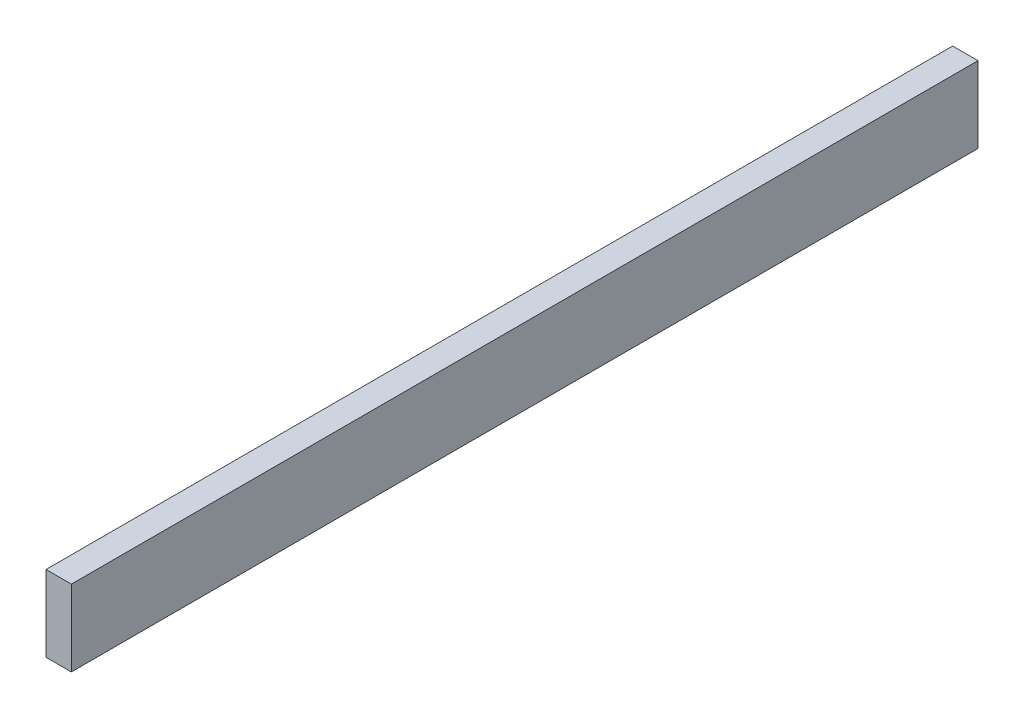
ISO-10303-21;
HEADER;
FILE_DESCRIPTION(('STEP AP214'),'2;1');
FILE_NAME('part.step','',(''),(''),'','','');
FILE_SCHEMA(('AUTOMOTIVE_DESIGN { 1 0 10303 214 1 1 1 1 }'));
ENDSEC;
DATA;
#1=APPLICATION_CONTEXT('core data for automotive mechanical design processes');
#2=APPLICATION_PROTOCOL_DEFINITION('international standard','automotive_design',2000,#1);
#3=PRODUCT_CONTEXT('',#1,'mechanical');
#4=PRODUCT('Part','Part','',(#3));
#5=PRODUCT_RELATED_PRODUCT_CATEGORY('part','',(#4));
#6=PRODUCT_DEFINITION_FORMATION('','',#4);
#7=PRODUCT_DEFINITION_CONTEXT('part definition',#1,'design');
#8=PRODUCT_DEFINITION('design','',#6,#7);
#9=PRODUCT_DEFINITION_SHAPE('','',#8);
#10=(LENGTH_UNIT() NAMED_UNIT(*) SI_UNIT(.MILLI.,.METRE.));
#11=(NAMED_UNIT(*) PLANE_ANGLE_UNIT() SI_UNIT($,.RADIAN.));
#12=(NAMED_UNIT(*) SI_UNIT($,.STERADIAN.) SOLID_ANGLE_UNIT());
#13=UNCERTAINTY_MEASURE_WITH_UNIT(LENGTH_MEASURE(1.E-05),#10,'distance_accuracy_value','');
#14=(GEOMETRIC_REPRESENTATION_CONTEXT(3) GLOBAL_UNCERTAINTY_ASSIGNED_CONTEXT((#13)) GLOBAL_UNIT_ASSIGNED_CONTEXT((#10,
#11,#12)) REPRESENTATION_CONTEXT('',''));
#15=CARTESIAN_POINT('',(0.,0.,0.));
#16=DIRECTION('',(0.,0.,1.));
#17=DIRECTION('',(1.,0.,0.));
#18=AXIS2_PLACEMENT_3D('',#15,#16,#17);
#19=CARTESIAN_POINT('',(-10.,60.,357.5));
#20=DIRECTION('',(0.,0.,-1.));
#21=DIRECTION('',(-1.,0.,0.));
#22=AXIS2_PLACEMENT_3D('',#19,#20,#21);
#23=PLANE('',#22);
#24=DIRECTION('',(1.,0.,0.));
#25=VECTOR('',#24,1.);
#26=CARTESIAN_POINT('',(-10.,0.,357.5));
#27=LINE('',#26,#25);
#28=CARTESIAN_POINT('',(-10.,0.,357.5));
#29=VERTEX_POINT('',#28);
#30=CARTESIAN_POINT('',(10.,0.,357.5));
#31=VERTEX_POINT('',#30);
#32=EDGE_CURVE('E98',#29,#31,#27,.T.);
#33=ORIENTED_EDGE('',*,*,#32,.T.);
#34=DIRECTION('',(0.,-1.,0.));
#35=VECTOR('',#34,1.);
#36=CARTESIAN_POINT('',(10.,60.,357.5));
#37=LINE('',#36,#35);
#38=CARTESIAN_POINT('',(10.,60.,357.5));
#39=VERTEX_POINT('',#38);
#40=EDGE_CURVE('E11',#39,#31,#37,.T.);
#41=ORIENTED_EDGE('',*,*,#40,.F.);
#42=DIRECTION('',(1.,0.,0.));
#43=VECTOR('',#42,1.);
#44=CARTESIAN_POINT('',(-10.,60.,357.5));
#45=LINE('',#44,#43);
#46=CARTESIAN_POINT('',(-10.,60.,357.5));
#47=VERTEX_POINT('',#46);
#48=EDGE_CURVE('E84',#47,#39,#45,.T.);
#49=ORIENTED_EDGE('',*,*,#48,.F.);
#50=DIRECTION('',(0.,-1.,0.));
#51=VECTOR('',#50,1.);
#52=CARTESIAN_POINT('',(-10.,60.,357.5));
#53=LINE('',#52,#51);
#54=EDGE_CURVE('E51',#47,#29,#53,.T.);
#55=ORIENTED_EDGE('',*,*,#54,.T.);
#56=EDGE_LOOP('',(#33,#41,#49,#55));
#57=FACE_BOUND('',#56,.T.);
#58=ADVANCED_FACE('F35',(#57),#23,.F.);
#59=CARTESIAN_POINT('',(10.,60.,357.5));
#60=DIRECTION('',(-1.,0.,0.));
#61=DIRECTION('',(0.,0.,1.));
#62=AXIS2_PLACEMENT_3D('',#59,#60,#61);
#63=PLANE('',#62);
#64=DIRECTION('',(0.,0.,-1.));
#65=VECTOR('',#64,1.);
#66=CARTESIAN_POINT('',(10.,0.,357.5));
#67=LINE('',#66,#65);
#68=CARTESIAN_POINT('',(10.,0.,-357.5));
#69=VERTEX_POINT('',#68);
#70=EDGE_CURVE('E89',#31,#69,#67,.T.);
#71=ORIENTED_EDGE('',*,*,#70,.T.);
#72=DIRECTION('',(0.,-1.,0.));
#73=VECTOR('',#72,1.);
#74=CARTESIAN_POINT('',(10.,60.,-357.5));
#75=LINE('',#74,#73);
#76=CARTESIAN_POINT('',(10.,60.,-357.5));
#77=VERTEX_POINT('',#76);
#78=EDGE_CURVE('E43',#77,#69,#75,.T.);
#79=ORIENTED_EDGE('',*,*,#78,.F.);
#80=DIRECTION('',(0.,0.,-1.));
#81=VECTOR('',#80,1.);
#82=CARTESIAN_POINT('',(10.,60.,357.5));
#83=LINE('',#82,#81);
#84=EDGE_CURVE('E76',#39,#77,#83,.T.);
#85=ORIENTED_EDGE('',*,*,#84,.F.);
#86=ORIENTED_EDGE('',*,*,#40,.T.);
#87=EDGE_LOOP('',(#71,#79,#85,#86));
#88=FACE_BOUND('',#87,.T.);
#89=ADVANCED_FACE('F88',(#88),#63,.F.);
#90=CARTESIAN_POINT('',(-10.,60.,-357.5));
#91=DIRECTION('',(0.,0.,-1.));
#92=DIRECTION('',(-1.,0.,0.));
#93=AXIS2_PLACEMENT_3D('',#90,#91,#92);
#94=PLANE('',#93);
#95=DIRECTION('',(1.,0.,0.));
#96=VECTOR('',#95,1.);
#97=CARTESIAN_POINT('',(-10.,0.,-357.5));
#98=LINE('',#97,#96);
#99=CARTESIAN_POINT('',(-10.,0.,-357.5));
#100=VERTEX_POINT('',#99);
#101=EDGE_CURVE('E101',#100,#69,#98,.T.);
#102=ORIENTED_EDGE('',*,*,#101,.F.);
#103=DIRECTION('',(0.,-1.,0.));
#104=VECTOR('',#103,1.);
#105=CARTESIAN_POINT('',(-10.,60.,-357.5));
#106=LINE('',#105,#104);
#107=CARTESIAN_POINT('',(-10.,60.,-357.5));
#108=VERTEX_POINT('',#107);
#109=EDGE_CURVE('E65',#108,#100,#106,.T.);
#110=ORIENTED_EDGE('',*,*,#109,.F.);
#111=DIRECTION('',(1.,0.,0.));
#112=VECTOR('',#111,1.);
#113=CARTESIAN_POINT('',(-10.,60.,-357.5));
#114=LINE('',#113,#112);
#115=EDGE_CURVE('E83',#108,#77,#114,.T.);
#116=ORIENTED_EDGE('',*,*,#115,.T.);
#117=ORIENTED_EDGE('',*,*,#78,.T.);
#118=EDGE_LOOP('',(#102,#110,#116,#117));
#119=FACE_BOUND('',#118,.T.);
#120=ADVANCED_FACE('F92',(#119),#94,.T.);
#121=CARTESIAN_POINT('',(-10.,60.,357.5));
#122=DIRECTION('',(-1.,0.,0.));
#123=DIRECTION('',(0.,0.,1.));
#124=AXIS2_PLACEMENT_3D('',#121,#122,#123);
#125=PLANE('',#124);
#126=DIRECTION('',(0.,0.,-1.));
#127=VECTOR('',#126,1.);
#128=CARTESIAN_POINT('',(-10.,0.,357.5));
#129=LINE('',#128,#127);
#130=EDGE_CURVE('E103',#29,#100,#129,.T.);
#131=ORIENTED_EDGE('',*,*,#130,.F.);
#132=ORIENTED_EDGE('',*,*,#54,.F.);
#133=DIRECTION('',(0.,0.,-1.));
#134=VECTOR('',#133,1.);
#135=CARTESIAN_POINT('',(-10.,60.,357.5));
#136=LINE('',#135,#134);
#137=EDGE_CURVE('E93',#47,#108,#136,.T.);
#138=ORIENTED_EDGE('',*,*,#137,.T.);
#139=ORIENTED_EDGE('',*,*,#109,.T.);
#140=EDGE_LOOP('',(#131,#132,#138,#139));
#141=FACE_BOUND('',#140,.T.);
#142=ADVANCED_FACE('F109',(#141),#125,.T.);
#143=CARTESIAN_POINT('',(0.,60.,0.));
#144=DIRECTION('',(0.,1.,0.));
#145=DIRECTION('',(0.,0.,1.));
#146=AXIS2_PLACEMENT_3D('',#143,#144,#145);
#147=PLANE('',#146);
#148=ORIENTED_EDGE('',*,*,#48,.T.);
#149=ORIENTED_EDGE('',*,*,#84,.T.);
#150=ORIENTED_EDGE('',*,*,#115,.F.);
#151=ORIENTED_EDGE('',*,*,#137,.F.);
#152=EDGE_LOOP('',(#148,#149,#150,#151));
#153=FACE_BOUND('',#152,.T.);
#154=ADVANCED_FACE('F80',(#153),#147,.T.);
#155=CARTESIAN_POINT('',(0.,0.,0.));
#156=DIRECTION('',(0.,1.,0.));
#157=DIRECTION('',(0.,0.,1.));
#158=AXIS2_PLACEMENT_3D('',#155,#156,#157);
#159=PLANE('',#158);
#160=ORIENTED_EDGE('',*,*,#32,.F.);
#161=ORIENTED_EDGE('',*,*,#130,.T.);
#162=ORIENTED_EDGE('',*,*,#101,.T.);
#163=ORIENTED_EDGE('',*,*,#70,.F.);
#164=EDGE_LOOP('',(#160,#161,#162,#163));
#165=FACE_BOUND('',#164,.T.);
#166=ADVANCED_FACE('F108',(#165),#159,.F.);
#167=CLOSED_SHELL('',(#58,#89,#120,#142,#154,#166));
#168=MANIFOLD_SOLID_BREP('B2',#167);
#169=ADVANCED_BREP_SHAPE_REPRESENTATION('',(#18,#168),#14);
#170=SHAPE_DEFINITION_REPRESENTATION(#9,#169);
ENDSEC;
END-ISO-10303-21;
